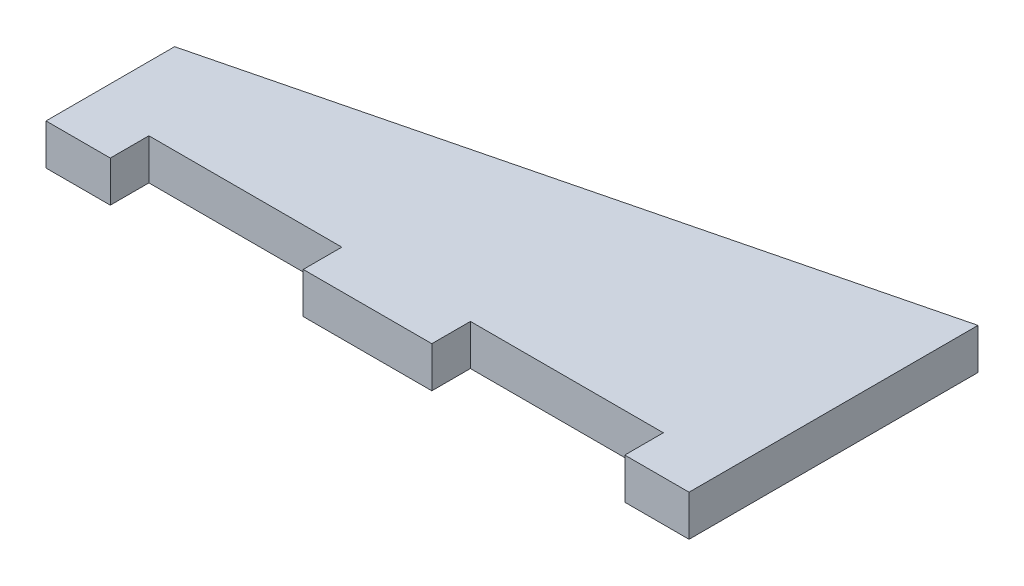
ISO-10303-21;
HEADER;
FILE_DESCRIPTION(('STEP AP214'),'2;1');
FILE_NAME('part.step','',(''),(''),'','','');
FILE_SCHEMA(('AUTOMOTIVE_DESIGN { 1 0 10303 214 1 1 1 1 }'));
ENDSEC;
DATA;
#1=APPLICATION_CONTEXT('core data for automotive mechanical design processes');
#2=APPLICATION_PROTOCOL_DEFINITION('international standard','automotive_design',2000,#1);
#3=PRODUCT_CONTEXT('',#1,'mechanical');
#4=PRODUCT('Part','Part','',(#3));
#5=PRODUCT_RELATED_PRODUCT_CATEGORY('part','',(#4));
#6=PRODUCT_DEFINITION_FORMATION('','',#4);
#7=PRODUCT_DEFINITION_CONTEXT('part definition',#1,'design');
#8=PRODUCT_DEFINITION('design','',#6,#7);
#9=PRODUCT_DEFINITION_SHAPE('','',#8);
#10=(LENGTH_UNIT() NAMED_UNIT(*) SI_UNIT(.MILLI.,.METRE.));
#11=(NAMED_UNIT(*) PLANE_ANGLE_UNIT() SI_UNIT($,.RADIAN.));
#12=(NAMED_UNIT(*) SI_UNIT($,.STERADIAN.) SOLID_ANGLE_UNIT());
#13=UNCERTAINTY_MEASURE_WITH_UNIT(LENGTH_MEASURE(1.E-05),#10,'distance_accuracy_value','');
#14=(GEOMETRIC_REPRESENTATION_CONTEXT(3) GLOBAL_UNCERTAINTY_ASSIGNED_CONTEXT((#13)) GLOBAL_UNIT_ASSIGNED_CONTEXT((#10,
#11,#12)) REPRESENTATION_CONTEXT('',''));
#15=CARTESIAN_POINT('',(0.,0.,0.));
#16=DIRECTION('',(0.,0.,1.));
#17=DIRECTION('',(1.,0.,0.));
#18=AXIS2_PLACEMENT_3D('',#15,#16,#17);
#19=CARTESIAN_POINT('',(10.,6.35,0.));
#20=DIRECTION('',(-1.,0.,0.));
#21=DIRECTION('',(0.,0.,1.));
#22=AXIS2_PLACEMENT_3D('',#19,#20,#21);
#23=PLANE('',#22);
#24=DIRECTION('',(0.,0.,-1.));
#25=VECTOR('',#24,1.);
#26=CARTESIAN_POINT('',(10.,0.,0.));
#27=LINE('',#26,#25);
#28=CARTESIAN_POINT('',(10.,0.,0.));
#29=VERTEX_POINT('',#28);
#30=CARTESIAN_POINT('',(10.,0.,-6.));
#31=VERTEX_POINT('',#30);
#32=EDGE_CURVE('E153',#29,#31,#27,.T.);
#33=ORIENTED_EDGE('',*,*,#32,.T.);
#34=DIRECTION('',(0.,-1.,0.));
#35=VECTOR('',#34,1.);
#36=CARTESIAN_POINT('',(10.,6.35,-6.));
#37=LINE('',#36,#35);
#38=CARTESIAN_POINT('',(10.,6.35,-6.));
#39=VERTEX_POINT('',#38);
#40=EDGE_CURVE('E11',#39,#31,#37,.T.);
#41=ORIENTED_EDGE('',*,*,#40,.F.);
#42=DIRECTION('',(0.,0.,-1.));
#43=VECTOR('',#42,1.);
#44=CARTESIAN_POINT('',(10.,6.35,0.));
#45=LINE('',#44,#43);
#46=CARTESIAN_POINT('',(10.,6.35,0.));
#47=VERTEX_POINT('',#46);
#48=EDGE_CURVE('E175',#47,#39,#45,.T.);
#49=ORIENTED_EDGE('',*,*,#48,.F.);
#50=DIRECTION('',(0.,-1.,0.));
#51=VECTOR('',#50,1.);
#52=CARTESIAN_POINT('',(10.,6.35,0.));
#53=LINE('',#52,#51);
#54=EDGE_CURVE('E149',#47,#29,#53,.T.);
#55=ORIENTED_EDGE('',*,*,#54,.T.);
#56=EDGE_LOOP('',(#33,#41,#49,#55));
#57=FACE_BOUND('',#56,.T.);
#58=ADVANCED_FACE('F33',(#57),#23,.F.);
#59=CARTESIAN_POINT('',(10.,6.35,-6.));
#60=DIRECTION('',(0.,0.,-1.));
#61=DIRECTION('',(-1.,0.,0.));
#62=AXIS2_PLACEMENT_3D('',#59,#60,#61);
#63=PLANE('',#62);
#64=DIRECTION('',(1.,0.,0.));
#65=VECTOR('',#64,1.);
#66=CARTESIAN_POINT('',(10.,0.,-6.));
#67=LINE('',#66,#65);
#68=CARTESIAN_POINT('',(40.,0.,-6.));
#69=VERTEX_POINT('',#68);
#70=EDGE_CURVE('E156',#31,#69,#67,.T.);
#71=ORIENTED_EDGE('',*,*,#70,.T.);
#72=DIRECTION('',(0.,-1.,0.));
#73=VECTOR('',#72,1.);
#74=CARTESIAN_POINT('',(40.,6.35,-6.));
#75=LINE('',#74,#73);
#76=CARTESIAN_POINT('',(40.,6.35,-6.));
#77=VERTEX_POINT('',#76);
#78=EDGE_CURVE('E41',#77,#69,#75,.T.);
#79=ORIENTED_EDGE('',*,*,#78,.F.);
#80=DIRECTION('',(1.,0.,0.));
#81=VECTOR('',#80,1.);
#82=CARTESIAN_POINT('',(10.,6.35,-6.));
#83=LINE('',#82,#81);
#84=EDGE_CURVE('E104',#39,#77,#83,.T.);
#85=ORIENTED_EDGE('',*,*,#84,.F.);
#86=ORIENTED_EDGE('',*,*,#40,.T.);
#87=EDGE_LOOP('',(#71,#79,#85,#86));
#88=FACE_BOUND('',#87,.T.);
#89=ADVANCED_FACE('F253',(#88),#63,.F.);
#90=CARTESIAN_POINT('',(40.,6.35,-6.));
#91=DIRECTION('',(1.,0.,0.));
#92=DIRECTION('',(0.,0.,-1.));
#93=AXIS2_PLACEMENT_3D('',#90,#91,#92);
#94=PLANE('',#93);
#95=DIRECTION('',(0.,0.,1.));
#96=VECTOR('',#95,1.);
#97=CARTESIAN_POINT('',(40.,0.,-6.));
#98=LINE('',#97,#96);
#99=CARTESIAN_POINT('',(40.,0.,0.));
#100=VERTEX_POINT('',#99);
#101=EDGE_CURVE('E158',#69,#100,#98,.T.);
#102=ORIENTED_EDGE('',*,*,#101,.T.);
#103=DIRECTION('',(0.,-1.,0.));
#104=VECTOR('',#103,1.);
#105=CARTESIAN_POINT('',(40.,6.35,0.));
#106=LINE('',#105,#104);
#107=CARTESIAN_POINT('',(40.,6.35,0.));
#108=VERTEX_POINT('',#107);
#109=EDGE_CURVE('E194',#108,#100,#106,.T.);
#110=ORIENTED_EDGE('',*,*,#109,.F.);
#111=DIRECTION('',(0.,0.,1.));
#112=VECTOR('',#111,1.);
#113=CARTESIAN_POINT('',(40.,6.35,-6.));
#114=LINE('',#113,#112);
#115=EDGE_CURVE('E202',#77,#108,#114,.T.);
#116=ORIENTED_EDGE('',*,*,#115,.F.);
#117=ORIENTED_EDGE('',*,*,#78,.T.);
#118=EDGE_LOOP('',(#102,#110,#116,#117));
#119=FACE_BOUND('',#118,.T.);
#120=ADVANCED_FACE('F200',(#119),#94,.F.);
#121=CARTESIAN_POINT('',(40.,6.35,0.));
#122=DIRECTION('',(0.,0.,-1.));
#123=DIRECTION('',(-1.,0.,0.));
#124=AXIS2_PLACEMENT_3D('',#121,#122,#123);
#125=PLANE('',#124);
#126=DIRECTION('',(1.,0.,0.));
#127=VECTOR('',#126,1.);
#128=CARTESIAN_POINT('',(40.,0.,0.));
#129=LINE('',#128,#127);
#130=CARTESIAN_POINT('',(60.,0.,0.));
#131=VERTEX_POINT('',#130);
#132=EDGE_CURVE('E160',#100,#131,#129,.T.);
#133=ORIENTED_EDGE('',*,*,#132,.T.);
#134=DIRECTION('',(0.,-1.,0.));
#135=VECTOR('',#134,1.);
#136=CARTESIAN_POINT('',(60.,6.35,0.));
#137=LINE('',#136,#135);
#138=CARTESIAN_POINT('',(60.,6.35,0.));
#139=VERTEX_POINT('',#138);
#140=EDGE_CURVE('E191',#139,#131,#137,.T.);
#141=ORIENTED_EDGE('',*,*,#140,.F.);
#142=DIRECTION('',(1.,0.,0.));
#143=VECTOR('',#142,1.);
#144=CARTESIAN_POINT('',(40.,6.35,0.));
#145=LINE('',#144,#143);
#146=EDGE_CURVE('E220',#108,#139,#145,.T.);
#147=ORIENTED_EDGE('',*,*,#146,.F.);
#148=ORIENTED_EDGE('',*,*,#109,.T.);
#149=EDGE_LOOP('',(#133,#141,#147,#148));
#150=FACE_BOUND('',#149,.T.);
#151=ADVANCED_FACE('F211',(#150),#125,.F.);
#152=CARTESIAN_POINT('',(60.,6.35,0.));
#153=DIRECTION('',(-1.,0.,0.));
#154=DIRECTION('',(0.,0.,1.));
#155=AXIS2_PLACEMENT_3D('',#152,#153,#154);
#156=PLANE('',#155);
#157=DIRECTION('',(0.,0.,-1.));
#158=VECTOR('',#157,1.);
#159=CARTESIAN_POINT('',(60.,0.,0.));
#160=LINE('',#159,#158);
#161=CARTESIAN_POINT('',(60.,0.,-6.));
#162=VERTEX_POINT('',#161);
#163=EDGE_CURVE('E162',#131,#162,#160,.T.);
#164=ORIENTED_EDGE('',*,*,#163,.T.);
#165=DIRECTION('',(0.,-1.,0.));
#166=VECTOR('',#165,1.);
#167=CARTESIAN_POINT('',(60.,6.35,-6.));
#168=LINE('',#167,#166);
#169=CARTESIAN_POINT('',(60.,6.35,-6.));
#170=VERTEX_POINT('',#169);
#171=EDGE_CURVE('E188',#170,#162,#168,.T.);
#172=ORIENTED_EDGE('',*,*,#171,.F.);
#173=DIRECTION('',(0.,0.,-1.));
#174=VECTOR('',#173,1.);
#175=CARTESIAN_POINT('',(60.,6.35,0.));
#176=LINE('',#175,#174);
#177=EDGE_CURVE('E217',#139,#170,#176,.T.);
#178=ORIENTED_EDGE('',*,*,#177,.F.);
#179=ORIENTED_EDGE('',*,*,#140,.T.);
#180=EDGE_LOOP('',(#164,#172,#178,#179));
#181=FACE_BOUND('',#180,.T.);
#182=ADVANCED_FACE('F215',(#181),#156,.F.);
#183=CARTESIAN_POINT('',(60.,6.35,-6.));
#184=DIRECTION('',(0.,0.,-1.));
#185=DIRECTION('',(-1.,0.,0.));
#186=AXIS2_PLACEMENT_3D('',#183,#184,#185);
#187=PLANE('',#186);
#188=DIRECTION('',(1.,0.,0.));
#189=VECTOR('',#188,1.);
#190=CARTESIAN_POINT('',(60.,0.,-6.));
#191=LINE('',#190,#189);
#192=CARTESIAN_POINT('',(90.,0.,-6.));
#193=VERTEX_POINT('',#192);
#194=EDGE_CURVE('E164',#162,#193,#191,.T.);
#195=ORIENTED_EDGE('',*,*,#194,.T.);
#196=DIRECTION('',(0.,-1.,0.));
#197=VECTOR('',#196,1.);
#198=CARTESIAN_POINT('',(90.,6.35,-6.));
#199=LINE('',#198,#197);
#200=CARTESIAN_POINT('',(90.,6.35,-6.));
#201=VERTEX_POINT('',#200);
#202=EDGE_CURVE('E185',#201,#193,#199,.T.);
#203=ORIENTED_EDGE('',*,*,#202,.F.);
#204=DIRECTION('',(1.,0.,0.));
#205=VECTOR('',#204,1.);
#206=CARTESIAN_POINT('',(60.,6.35,-6.));
#207=LINE('',#206,#205);
#208=EDGE_CURVE('E219',#170,#201,#207,.T.);
#209=ORIENTED_EDGE('',*,*,#208,.F.);
#210=ORIENTED_EDGE('',*,*,#171,.T.);
#211=EDGE_LOOP('',(#195,#203,#209,#210));
#212=FACE_BOUND('',#211,.T.);
#213=ADVANCED_FACE('F266',(#212),#187,.F.);
#214=CARTESIAN_POINT('',(90.,6.35,-6.));
#215=DIRECTION('',(1.,0.,0.));
#216=DIRECTION('',(0.,0.,-1.));
#217=AXIS2_PLACEMENT_3D('',#214,#215,#216);
#218=PLANE('',#217);
#219=DIRECTION('',(0.,0.,1.));
#220=VECTOR('',#219,1.);
#221=CARTESIAN_POINT('',(90.,0.,-6.));
#222=LINE('',#221,#220);
#223=CARTESIAN_POINT('',(90.,0.,0.));
#224=VERTEX_POINT('',#223);
#225=EDGE_CURVE('E166',#193,#224,#222,.T.);
#226=ORIENTED_EDGE('',*,*,#225,.T.);
#227=DIRECTION('',(0.,-1.,0.));
#228=VECTOR('',#227,1.);
#229=CARTESIAN_POINT('',(90.,6.35,0.));
#230=LINE('',#229,#228);
#231=CARTESIAN_POINT('',(90.,6.35,0.));
#232=VERTEX_POINT('',#231);
#233=EDGE_CURVE('E182',#232,#224,#230,.T.);
#234=ORIENTED_EDGE('',*,*,#233,.F.);
#235=DIRECTION('',(0.,0.,1.));
#236=VECTOR('',#235,1.);
#237=CARTESIAN_POINT('',(90.,6.35,-6.));
#238=LINE('',#237,#236);
#239=EDGE_CURVE('E222',#201,#232,#238,.T.);
#240=ORIENTED_EDGE('',*,*,#239,.F.);
#241=ORIENTED_EDGE('',*,*,#202,.T.);
#242=EDGE_LOOP('',(#226,#234,#240,#241));
#243=FACE_BOUND('',#242,.T.);
#244=ADVANCED_FACE('F269',(#243),#218,.F.);
#245=CARTESIAN_POINT('',(90.,6.35,0.));
#246=DIRECTION('',(0.,0.,-1.));
#247=DIRECTION('',(-1.,0.,0.));
#248=AXIS2_PLACEMENT_3D('',#245,#246,#247);
#249=PLANE('',#248);
#250=DIRECTION('',(1.,0.,0.));
#251=VECTOR('',#250,1.);
#252=CARTESIAN_POINT('',(90.,0.,0.));
#253=LINE('',#252,#251);
#254=CARTESIAN_POINT('',(100.,0.,0.));
#255=VERTEX_POINT('',#254);
#256=EDGE_CURVE('E168',#224,#255,#253,.T.);
#257=ORIENTED_EDGE('',*,*,#256,.T.);
#258=DIRECTION('',(0.,-1.,0.));
#259=VECTOR('',#258,1.);
#260=CARTESIAN_POINT('',(100.,6.35,0.));
#261=LINE('',#260,#259);
#262=CARTESIAN_POINT('',(100.,6.35,0.));
#263=VERTEX_POINT('',#262);
#264=EDGE_CURVE('E179',#263,#255,#261,.T.);
#265=ORIENTED_EDGE('',*,*,#264,.F.);
#266=DIRECTION('',(1.,0.,0.));
#267=VECTOR('',#266,1.);
#268=CARTESIAN_POINT('',(90.,6.35,0.));
#269=LINE('',#268,#267);
#270=EDGE_CURVE('E228',#232,#263,#269,.T.);
#271=ORIENTED_EDGE('',*,*,#270,.F.);
#272=ORIENTED_EDGE('',*,*,#233,.T.);
#273=EDGE_LOOP('',(#257,#265,#271,#272));
#274=FACE_BOUND('',#273,.T.);
#275=ADVANCED_FACE('F234',(#274),#249,.F.);
#276=CARTESIAN_POINT('',(100.,6.35,0.));
#277=DIRECTION('',(-1.,0.,0.));
#278=DIRECTION('',(0.,0.,1.));
#279=AXIS2_PLACEMENT_3D('',#276,#277,#278);
#280=PLANE('',#279);
#281=DIRECTION('',(0.,0.,-1.));
#282=VECTOR('',#281,1.);
#283=CARTESIAN_POINT('',(100.,0.,0.));
#284=LINE('',#283,#282);
#285=CARTESIAN_POINT('',(100.,0.,-44.9328002843178));
#286=VERTEX_POINT('',#285);
#287=EDGE_CURVE('E170',#255,#286,#284,.T.);
#288=ORIENTED_EDGE('',*,*,#287,.T.);
#289=DIRECTION('',(0.,-1.,0.));
#290=VECTOR('',#289,1.);
#291=CARTESIAN_POINT('',(100.,6.35,-44.9328002843178));
#292=LINE('',#291,#290);
#293=CARTESIAN_POINT('',(100.,6.35,-44.9328002843178));
#294=VERTEX_POINT('',#293);
#295=EDGE_CURVE('E144',#294,#286,#292,.T.);
#296=ORIENTED_EDGE('',*,*,#295,.F.);
#297=DIRECTION('',(0.,0.,-1.));
#298=VECTOR('',#297,1.);
#299=CARTESIAN_POINT('',(100.,6.35,0.));
#300=LINE('',#299,#298);
#301=EDGE_CURVE('E135',#263,#294,#300,.T.);
#302=ORIENTED_EDGE('',*,*,#301,.F.);
#303=ORIENTED_EDGE('',*,*,#264,.T.);
#304=EDGE_LOOP('',(#288,#296,#302,#303));
#305=FACE_BOUND('',#304,.T.);
#306=ADVANCED_FACE('F238',(#305),#280,.F.);
#307=CARTESIAN_POINT('',(100.,6.35,-44.9328002843178));
#308=DIRECTION('',(0.241921895599665,0.,0.970295726275997));
#309=DIRECTION('',(0.970295726275997,0.,-0.241921895599665));
#310=AXIS2_PLACEMENT_3D('',#307,#308,#309);
#311=PLANE('',#310);
#312=DIRECTION('',(-0.970295726275997,0.,0.241921895599665));
#313=VECTOR('',#312,1.);
#314=CARTESIAN_POINT('',(100.,0.,-44.9328002843178));
#315=LINE('',#314,#313);
#316=CARTESIAN_POINT('',(0.,0.,-20.));
#317=VERTEX_POINT('',#316);
#318=EDGE_CURVE('E143',#286,#317,#315,.T.);
#319=ORIENTED_EDGE('',*,*,#318,.T.);
#320=DIRECTION('',(0.,-1.,0.));
#321=VECTOR('',#320,1.);
#322=CARTESIAN_POINT('',(0.,6.35,-20.));
#323=LINE('',#322,#321);
#324=CARTESIAN_POINT('',(0.,6.35,-20.));
#325=VERTEX_POINT('',#324);
#326=EDGE_CURVE('E140',#325,#317,#323,.T.);
#327=ORIENTED_EDGE('',*,*,#326,.F.);
#328=DIRECTION('',(-0.970295726275997,0.,0.241921895599665));
#329=VECTOR('',#328,1.);
#330=CARTESIAN_POINT('',(100.,6.35,-44.9328002843178));
#331=LINE('',#330,#329);
#332=EDGE_CURVE('E129',#294,#325,#331,.T.);
#333=ORIENTED_EDGE('',*,*,#332,.F.);
#334=ORIENTED_EDGE('',*,*,#295,.T.);
#335=EDGE_LOOP('',(#319,#327,#333,#334));
#336=FACE_BOUND('',#335,.T.);
#337=ADVANCED_FACE('F141',(#336),#311,.F.);
#338=CARTESIAN_POINT('',(0.,6.35,-20.));
#339=DIRECTION('',(1.,0.,0.));
#340=DIRECTION('',(0.,0.,-1.));
#341=AXIS2_PLACEMENT_3D('',#338,#339,#340);
#342=PLANE('',#341);
#343=DIRECTION('',(0.,0.,1.));
#344=VECTOR('',#343,1.);
#345=CARTESIAN_POINT('',(0.,0.,-20.));
#346=LINE('',#345,#344);
#347=CARTESIAN_POINT('',(0.,0.,0.));
#348=VERTEX_POINT('',#347);
#349=EDGE_CURVE('E90',#317,#348,#346,.T.);
#350=ORIENTED_EDGE('',*,*,#349,.T.);
#351=DIRECTION('',(0.,-1.,0.));
#352=VECTOR('',#351,1.);
#353=CARTESIAN_POINT('',(0.,6.35,0.));
#354=LINE('',#353,#352);
#355=CARTESIAN_POINT('',(0.,6.35,0.));
#356=VERTEX_POINT('',#355);
#357=EDGE_CURVE('E145',#356,#348,#354,.T.);
#358=ORIENTED_EDGE('',*,*,#357,.F.);
#359=DIRECTION('',(0.,0.,1.));
#360=VECTOR('',#359,1.);
#361=CARTESIAN_POINT('',(0.,6.35,-20.));
#362=LINE('',#361,#360);
#363=EDGE_CURVE('E133',#325,#356,#362,.T.);
#364=ORIENTED_EDGE('',*,*,#363,.F.);
#365=ORIENTED_EDGE('',*,*,#326,.T.);
#366=EDGE_LOOP('',(#350,#358,#364,#365));
#367=FACE_BOUND('',#366,.T.);
#368=ADVANCED_FACE('F147',(#367),#342,.F.);
#369=CARTESIAN_POINT('',(0.,6.35,0.));
#370=DIRECTION('',(0.,0.,-1.));
#371=DIRECTION('',(-1.,0.,0.));
#372=AXIS2_PLACEMENT_3D('',#369,#370,#371);
#373=PLANE('',#372);
#374=DIRECTION('',(1.,0.,0.));
#375=VECTOR('',#374,1.);
#376=CARTESIAN_POINT('',(0.,0.,0.));
#377=LINE('',#376,#375);
#378=EDGE_CURVE('E96',#348,#29,#377,.T.);
#379=ORIENTED_EDGE('',*,*,#378,.T.);
#380=ORIENTED_EDGE('',*,*,#54,.F.);
#381=DIRECTION('',(1.,0.,0.));
#382=VECTOR('',#381,1.);
#383=CARTESIAN_POINT('',(0.,6.35,0.));
#384=LINE('',#383,#382);
#385=EDGE_CURVE('E49',#356,#47,#384,.T.);
#386=ORIENTED_EDGE('',*,*,#385,.F.);
#387=ORIENTED_EDGE('',*,*,#357,.T.);
#388=EDGE_LOOP('',(#379,#380,#386,#387));
#389=FACE_BOUND('',#388,.T.);
#390=ADVANCED_FACE('F242',(#389),#373,.F.);
#391=CARTESIAN_POINT('',(0.,6.35,0.));
#392=DIRECTION('',(0.,-1.,0.));
#393=DIRECTION('',(0.,0.,-1.));
#394=AXIS2_PLACEMENT_3D('',#391,#392,#393);
#395=PLANE('',#394);
#396=ORIENTED_EDGE('',*,*,#48,.T.);
#397=ORIENTED_EDGE('',*,*,#84,.T.);
#398=ORIENTED_EDGE('',*,*,#115,.T.);
#399=ORIENTED_EDGE('',*,*,#146,.T.);
#400=ORIENTED_EDGE('',*,*,#177,.T.);
#401=ORIENTED_EDGE('',*,*,#208,.T.);
#402=ORIENTED_EDGE('',*,*,#239,.T.);
#403=ORIENTED_EDGE('',*,*,#270,.T.);
#404=ORIENTED_EDGE('',*,*,#301,.T.);
#405=ORIENTED_EDGE('',*,*,#332,.T.);
#406=ORIENTED_EDGE('',*,*,#363,.T.);
#407=ORIENTED_EDGE('',*,*,#385,.T.);
#408=EDGE_LOOP('',(#396,#397,#398,#399,#400,#401,#402,#403,#404,#405,#406,#407));
#409=FACE_BOUND('',#408,.T.);
#410=ADVANCED_FACE('F131',(#409),#395,.F.);
#411=CARTESIAN_POINT('',(0.,0.,0.));
#412=DIRECTION('',(0.,-1.,0.));
#413=DIRECTION('',(0.,0.,-1.));
#414=AXIS2_PLACEMENT_3D('',#411,#412,#413);
#415=PLANE('',#414);
#416=ORIENTED_EDGE('',*,*,#32,.F.);
#417=ORIENTED_EDGE('',*,*,#378,.F.);
#418=ORIENTED_EDGE('',*,*,#349,.F.);
#419=ORIENTED_EDGE('',*,*,#318,.F.);
#420=ORIENTED_EDGE('',*,*,#287,.F.);
#421=ORIENTED_EDGE('',*,*,#256,.F.);
#422=ORIENTED_EDGE('',*,*,#225,.F.);
#423=ORIENTED_EDGE('',*,*,#194,.F.);
#424=ORIENTED_EDGE('',*,*,#163,.F.);
#425=ORIENTED_EDGE('',*,*,#132,.F.);
#426=ORIENTED_EDGE('',*,*,#101,.F.);
#427=ORIENTED_EDGE('',*,*,#70,.F.);
#428=EDGE_LOOP('',(#416,#417,#418,#419,#420,#421,#422,#423,#424,#425,#426,#427));
#429=FACE_BOUND('',#428,.T.);
#430=ADVANCED_FACE('F206',(#429),#415,.T.);
#431=CLOSED_SHELL('',(#58,#89,#120,#151,#182,#213,#244,#275,#306,#337,#368,#390,#410,#430));
#432=MANIFOLD_SOLID_BREP('B2',#431);
#433=ADVANCED_BREP_SHAPE_REPRESENTATION('',(#18,#432),#14);
#434=SHAPE_DEFINITION_REPRESENTATION(#9,#433);
ENDSEC;
END-ISO-10303-21;
